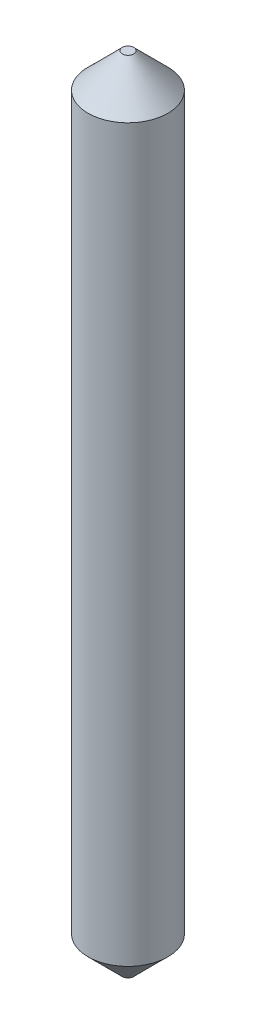
ISO-10303-21;
HEADER;
FILE_DESCRIPTION(('STEP AP214'),'2;1');
FILE_NAME('part.step','',(''),(''),'','','');
FILE_SCHEMA(('AUTOMOTIVE_DESIGN { 1 0 10303 214 1 1 1 1 }'));
ENDSEC;
DATA;
#1=APPLICATION_CONTEXT('core data for automotive mechanical design processes');
#2=APPLICATION_PROTOCOL_DEFINITION('international standard','automotive_design',2000,#1);
#3=PRODUCT_CONTEXT('',#1,'mechanical');
#4=PRODUCT('Part','Part','',(#3));
#5=PRODUCT_RELATED_PRODUCT_CATEGORY('part','',(#4));
#6=PRODUCT_DEFINITION_FORMATION('','',#4);
#7=PRODUCT_DEFINITION_CONTEXT('part definition',#1,'design');
#8=PRODUCT_DEFINITION('design','',#6,#7);
#9=PRODUCT_DEFINITION_SHAPE('','',#8);
#10=(LENGTH_UNIT() NAMED_UNIT(*) SI_UNIT(.MILLI.,.METRE.));
#11=(NAMED_UNIT(*) PLANE_ANGLE_UNIT() SI_UNIT($,.RADIAN.));
#12=(NAMED_UNIT(*) SI_UNIT($,.STERADIAN.) SOLID_ANGLE_UNIT());
#13=UNCERTAINTY_MEASURE_WITH_UNIT(LENGTH_MEASURE(1.E-05),#10,'distance_accuracy_value','');
#14=(GEOMETRIC_REPRESENTATION_CONTEXT(3) GLOBAL_UNCERTAINTY_ASSIGNED_CONTEXT((#13)) GLOBAL_UNIT_ASSIGNED_CONTEXT((#10,
#11,#12)) REPRESENTATION_CONTEXT('',''));
#15=CARTESIAN_POINT('',(0.,0.,0.));
#16=DIRECTION('',(0.,0.,1.));
#17=DIRECTION('',(1.,0.,0.));
#18=AXIS2_PLACEMENT_3D('',#15,#16,#17);
#19=CARTESIAN_POINT('',(0.,7.,0.));
#20=DIRECTION('',(0.,-1.,0.));
#21=DIRECTION('',(0.,0.,-1.));
#22=AXIS2_PLACEMENT_3D('',#19,#20,#21);
#23=CYLINDRICAL_SURFACE('',#22,0.35);
#24=CARTESIAN_POINT('',(0.,0.299999999999999,0.));
#25=DIRECTION('',(0.,1.,0.));
#26=DIRECTION('',(0.,0.,1.));
#27=AXIS2_PLACEMENT_3D('',#24,#25,#26);
#28=CIRCLE('',#27,0.35);
#29=CARTESIAN_POINT('',(0.,0.299999999999999,0.35));
#30=VERTEX_POINT('',#29);
#31=EDGE_CURVE('E45',#30,#30,#28,.T.);
#32=ORIENTED_EDGE('',*,*,#31,.T.);
#33=EDGE_LOOP('',(#32));
#34=FACE_BOUND('',#33,.T.);
#35=CARTESIAN_POINT('',(0.,6.7,0.));
#36=DIRECTION('',(0.,1.,0.));
#37=DIRECTION('',(0.,0.,1.));
#38=AXIS2_PLACEMENT_3D('',#35,#36,#37);
#39=CIRCLE('',#38,0.35);
#40=CARTESIAN_POINT('',(0.,6.7,0.35));
#41=VERTEX_POINT('',#40);
#42=EDGE_CURVE('E49',#41,#41,#39,.F.);
#43=ORIENTED_EDGE('',*,*,#42,.T.);
#44=EDGE_LOOP('',(#43));
#45=FACE_BOUND('',#44,.T.);
#46=ADVANCED_FACE('F34',(#34,#45),#23,.T.);
#47=CARTESIAN_POINT('',(0.,7.,0.));
#48=DIRECTION('',(0.,1.,0.));
#49=DIRECTION('',(0.,0.,1.));
#50=AXIS2_PLACEMENT_3D('',#47,#48,#49);
#51=PLANE('',#50);
#52=CARTESIAN_POINT('',(0.,7.,0.));
#53=DIRECTION('',(0.,1.,0.));
#54=DIRECTION('',(0.,0.,1.));
#55=AXIS2_PLACEMENT_3D('',#52,#53,#54);
#56=CIRCLE('',#55,0.0499999999999988);
#57=CARTESIAN_POINT('',(0.,7.,0.0499999999999988));
#58=VERTEX_POINT('',#57);
#59=EDGE_CURVE('E10',#58,#58,#56,.T.);
#60=ORIENTED_EDGE('',*,*,#59,.T.);
#61=EDGE_LOOP('',(#60));
#62=FACE_BOUND('',#61,.T.);
#63=ADVANCED_FACE('F65',(#62),#51,.T.);
#64=CARTESIAN_POINT('',(0.,0.,0.));
#65=DIRECTION('',(0.,1.,0.));
#66=DIRECTION('',(0.,0.,1.));
#67=AXIS2_PLACEMENT_3D('',#64,#65,#66);
#68=PLANE('',#67);
#69=CARTESIAN_POINT('',(0.,0.,0.));
#70=DIRECTION('',(0.,1.,0.));
#71=DIRECTION('',(0.,0.,1.));
#72=AXIS2_PLACEMENT_3D('',#69,#70,#71);
#73=CIRCLE('',#72,0.0499999999999997);
#74=CARTESIAN_POINT('',(0.,0.,0.0499999999999997));
#75=VERTEX_POINT('',#74);
#76=EDGE_CURVE('E41',#75,#75,#73,.F.);
#77=ORIENTED_EDGE('',*,*,#76,.T.);
#78=EDGE_LOOP('',(#77));
#79=FACE_BOUND('',#78,.T.);
#80=ADVANCED_FACE('F62',(#79),#68,.F.);
#81=CARTESIAN_POINT('',(0.,0.299999999999999,0.));
#82=DIRECTION('',(0.,1.,0.));
#83=DIRECTION('',(0.,0.,1.));
#84=AXIS2_PLACEMENT_3D('',#81,#82,#83);
#85=CONICAL_SURFACE('',#84,0.35,0.78539816339745);
#86=ORIENTED_EDGE('',*,*,#76,.F.);
#87=EDGE_LOOP('',(#86));
#88=FACE_BOUND('',#87,.T.);
#89=ORIENTED_EDGE('',*,*,#31,.F.);
#90=EDGE_LOOP('',(#89));
#91=FACE_BOUND('',#90,.T.);
#92=ADVANCED_FACE('F58',(#88,#91),#85,.T.);
#93=CARTESIAN_POINT('',(0.,7.,0.));
#94=DIRECTION('',(0.,-1.,0.));
#95=DIRECTION('',(0.,0.,-1.));
#96=AXIS2_PLACEMENT_3D('',#93,#94,#95);
#97=CONICAL_SURFACE('',#96,0.0499999999999988,0.785398163397446);
#98=ORIENTED_EDGE('',*,*,#42,.F.);
#99=EDGE_LOOP('',(#98));
#100=FACE_BOUND('',#99,.T.);
#101=ORIENTED_EDGE('',*,*,#59,.F.);
#102=EDGE_LOOP('',(#101));
#103=FACE_BOUND('',#102,.T.);
#104=ADVANCED_FACE('F36',(#100,#103),#97,.T.);
#105=CLOSED_SHELL('',(#46,#63,#80,#92,#104));
#106=MANIFOLD_SOLID_BREP('B2',#105);
#107=ADVANCED_BREP_SHAPE_REPRESENTATION('',(#18,#106),#14);
#108=SHAPE_DEFINITION_REPRESENTATION(#9,#107);
ENDSEC;
END-ISO-10303-21;
